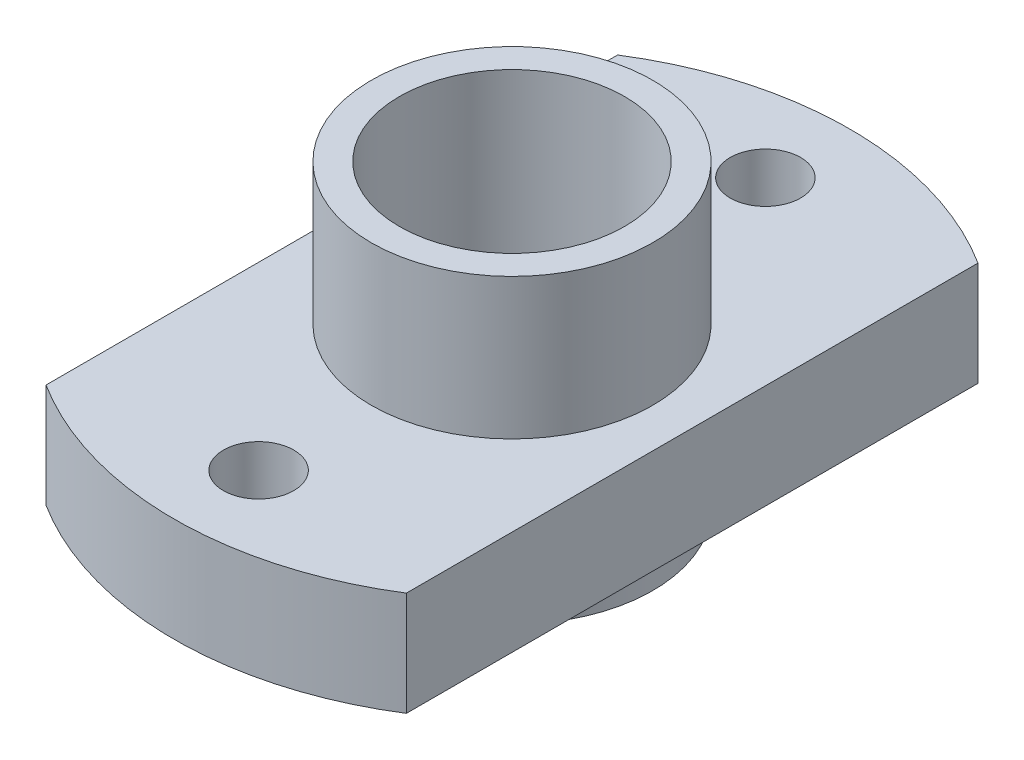
ISO-10303-21;
HEADER;
FILE_DESCRIPTION(('STEP AP214'),'2;1');
FILE_NAME('part.step','',(''),(''),'','','');
FILE_SCHEMA(('AUTOMOTIVE_DESIGN { 1 0 10303 214 1 1 1 1 }'));
ENDSEC;
DATA;
#1=APPLICATION_CONTEXT('core data for automotive mechanical design processes');
#2=APPLICATION_PROTOCOL_DEFINITION('international standard','automotive_design',2000,#1);
#3=PRODUCT_CONTEXT('',#1,'mechanical');
#4=PRODUCT('Part','Part','',(#3));
#5=PRODUCT_RELATED_PRODUCT_CATEGORY('part','',(#4));
#6=PRODUCT_DEFINITION_FORMATION('','',#4);
#7=PRODUCT_DEFINITION_CONTEXT('part definition',#1,'design');
#8=PRODUCT_DEFINITION('design','',#6,#7);
#9=PRODUCT_DEFINITION_SHAPE('','',#8);
#10=(LENGTH_UNIT() NAMED_UNIT(*) SI_UNIT(.MILLI.,.METRE.));
#11=(NAMED_UNIT(*) PLANE_ANGLE_UNIT() SI_UNIT($,.RADIAN.));
#12=(NAMED_UNIT(*) SI_UNIT($,.STERADIAN.) SOLID_ANGLE_UNIT());
#13=UNCERTAINTY_MEASURE_WITH_UNIT(LENGTH_MEASURE(1.E-05),#10,'distance_accuracy_value','');
#14=(GEOMETRIC_REPRESENTATION_CONTEXT(3) GLOBAL_UNCERTAINTY_ASSIGNED_CONTEXT((#13)) GLOBAL_UNIT_ASSIGNED_CONTEXT((#10,
#11,#12)) REPRESENTATION_CONTEXT('',''));
#15=CARTESIAN_POINT('',(0.,0.,0.));
#16=DIRECTION('',(0.,0.,1.));
#17=DIRECTION('',(1.,0.,0.));
#18=AXIS2_PLACEMENT_3D('',#15,#16,#17);
#19=CARTESIAN_POINT('',(0.,0.,0.));
#20=DIRECTION('',(0.,1.,0.));
#21=DIRECTION('',(0.,0.,1.));
#22=AXIS2_PLACEMENT_3D('',#19,#20,#21);
#23=PLANE('',#22);
#24=CARTESIAN_POINT('',(0.,0.,9.));
#25=DIRECTION('',(0.,-1.,0.));
#26=DIRECTION('',(0.,0.,-1.));
#27=AXIS2_PLACEMENT_3D('',#24,#25,#26);
#28=CIRCLE('',#27,1.24999999999999);
#29=CARTESIAN_POINT('',(0.,0.,7.75000000000001));
#30=VERTEX_POINT('',#29);
#31=EDGE_CURVE('E130',#30,#30,#28,.T.);
#32=ORIENTED_EDGE('',*,*,#31,.F.);
#33=EDGE_LOOP('',(#32));
#34=FACE_BOUND('',#33,.T.);
#35=CARTESIAN_POINT('',(0.,0.,0.));
#36=DIRECTION('',(0.,1.,0.));
#37=DIRECTION('',(0.,0.,1.));
#38=AXIS2_PLACEMENT_3D('',#35,#36,#37);
#39=CIRCLE('',#38,5.);
#40=CARTESIAN_POINT('',(0.,0.,5.));
#41=VERTEX_POINT('',#40);
#42=EDGE_CURVE('E40',#41,#41,#39,.T.);
#43=ORIENTED_EDGE('',*,*,#42,.T.);
#44=EDGE_LOOP('',(#43));
#45=FACE_BOUND('',#44,.T.);
#46=CARTESIAN_POINT('',(0.,0.,0.));
#47=DIRECTION('',(0.,1.,0.));
#48=DIRECTION('',(0.,0.,1.));
#49=AXIS2_PLACEMENT_3D('',#46,#47,#48);
#50=CIRCLE('',#49,12.);
#51=CARTESIAN_POINT('',(6.4,0.,-10.1508620323596));
#52=VERTEX_POINT('',#51);
#53=CARTESIAN_POINT('',(-6.4,0.,-10.1508620323596));
#54=VERTEX_POINT('',#53);
#55=EDGE_CURVE('E105',#52,#54,#50,.T.);
#56=ORIENTED_EDGE('',*,*,#55,.F.);
#57=DIRECTION('',(0.,0.,-1.));
#58=VECTOR('',#57,1.);
#59=CARTESIAN_POINT('',(6.4,0.,-10.1508620323596));
#60=LINE('',#59,#58);
#61=CARTESIAN_POINT('',(6.4,0.,10.1508620323596));
#62=VERTEX_POINT('',#61);
#63=EDGE_CURVE('E78',#62,#52,#60,.T.);
#64=ORIENTED_EDGE('',*,*,#63,.F.);
#65=CARTESIAN_POINT('',(0.,0.,0.));
#66=DIRECTION('',(0.,1.,0.));
#67=DIRECTION('',(0.,0.,1.));
#68=AXIS2_PLACEMENT_3D('',#65,#66,#67);
#69=CIRCLE('',#68,12.);
#70=CARTESIAN_POINT('',(-6.4,0.,10.1508620323596));
#71=VERTEX_POINT('',#70);
#72=EDGE_CURVE('E72',#71,#62,#69,.T.);
#73=ORIENTED_EDGE('',*,*,#72,.F.);
#74=DIRECTION('',(0.,0.,1.));
#75=VECTOR('',#74,1.);
#76=CARTESIAN_POINT('',(-6.4,0.,-10.1508620323596));
#77=LINE('',#76,#75);
#78=EDGE_CURVE('E96',#54,#71,#77,.T.);
#79=ORIENTED_EDGE('',*,*,#78,.F.);
#80=EDGE_LOOP('',(#56,#64,#73,#79));
#81=FACE_BOUND('',#80,.T.);
#82=CARTESIAN_POINT('',(0.,0.,-9.));
#83=DIRECTION('',(0.,-1.,0.));
#84=DIRECTION('',(0.,0.,-1.));
#85=AXIS2_PLACEMENT_3D('',#82,#83,#84);
#86=CIRCLE('',#85,1.24999999999999);
#87=CARTESIAN_POINT('',(0.,0.,-10.25));
#88=VERTEX_POINT('',#87);
#89=EDGE_CURVE('E121',#88,#88,#86,.T.);
#90=ORIENTED_EDGE('',*,*,#89,.F.);
#91=EDGE_LOOP('',(#90));
#92=FACE_BOUND('',#91,.T.);
#93=ADVANCED_FACE('F36',(#34,#45,#81,#92),#23,.F.);
#94=CARTESIAN_POINT('',(0.,3.7,0.));
#95=DIRECTION('',(0.,-1.,0.));
#96=DIRECTION('',(0.,0.,-1.));
#97=AXIS2_PLACEMENT_3D('',#94,#95,#96);
#98=CYLINDRICAL_SURFACE('',#97,12.);
#99=ORIENTED_EDGE('',*,*,#55,.T.);
#100=DIRECTION('',(0.,-1.,0.));
#101=VECTOR('',#100,1.);
#102=CARTESIAN_POINT('',(-6.4,3.7,-10.1508620323596));
#103=LINE('',#102,#101);
#104=CARTESIAN_POINT('',(-6.4,3.7,-10.1508620323596));
#105=VERTEX_POINT('',#104);
#106=EDGE_CURVE('E46',#105,#54,#103,.T.);
#107=ORIENTED_EDGE('',*,*,#106,.F.);
#108=CARTESIAN_POINT('',(0.,3.7,0.));
#109=DIRECTION('',(0.,1.,0.));
#110=DIRECTION('',(0.,0.,1.));
#111=AXIS2_PLACEMENT_3D('',#108,#109,#110);
#112=CIRCLE('',#111,12.);
#113=CARTESIAN_POINT('',(6.4,3.7,-10.1508620323596));
#114=VERTEX_POINT('',#113);
#115=EDGE_CURVE('E91',#114,#105,#112,.T.);
#116=ORIENTED_EDGE('',*,*,#115,.F.);
#117=DIRECTION('',(0.,-1.,0.));
#118=VECTOR('',#117,1.);
#119=CARTESIAN_POINT('',(6.4,3.7,-10.1508620323596));
#120=LINE('',#119,#118);
#121=EDGE_CURVE('E101',#114,#52,#120,.T.);
#122=ORIENTED_EDGE('',*,*,#121,.T.);
#123=EDGE_LOOP('',(#99,#107,#116,#122));
#124=FACE_BOUND('',#123,.T.);
#125=ADVANCED_FACE('F38',(#124),#98,.T.);
#126=CARTESIAN_POINT('',(-6.4,3.7,-10.1508620323596));
#127=DIRECTION('',(1.,0.,0.));
#128=DIRECTION('',(0.,0.,-1.));
#129=AXIS2_PLACEMENT_3D('',#126,#127,#128);
#130=PLANE('',#129);
#131=ORIENTED_EDGE('',*,*,#78,.T.);
#132=DIRECTION('',(0.,-1.,0.));
#133=VECTOR('',#132,1.);
#134=CARTESIAN_POINT('',(-6.4,3.7,10.1508620323596));
#135=LINE('',#134,#133);
#136=CARTESIAN_POINT('',(-6.4,3.7,10.1508620323596));
#137=VERTEX_POINT('',#136);
#138=EDGE_CURVE('E94',#137,#71,#135,.T.);
#139=ORIENTED_EDGE('',*,*,#138,.F.);
#140=DIRECTION('',(0.,0.,1.));
#141=VECTOR('',#140,1.);
#142=CARTESIAN_POINT('',(-6.4,3.7,-10.1508620323596));
#143=LINE('',#142,#141);
#144=EDGE_CURVE('E86',#105,#137,#143,.T.);
#145=ORIENTED_EDGE('',*,*,#144,.F.);
#146=ORIENTED_EDGE('',*,*,#106,.T.);
#147=EDGE_LOOP('',(#131,#139,#145,#146));
#148=FACE_BOUND('',#147,.T.);
#149=ADVANCED_FACE('F95',(#148),#130,.F.);
#150=CARTESIAN_POINT('',(0.,3.7,0.));
#151=DIRECTION('',(0.,-1.,0.));
#152=DIRECTION('',(0.,0.,-1.));
#153=AXIS2_PLACEMENT_3D('',#150,#151,#152);
#154=CYLINDRICAL_SURFACE('',#153,12.);
#155=ORIENTED_EDGE('',*,*,#72,.T.);
#156=DIRECTION('',(0.,-1.,0.));
#157=VECTOR('',#156,1.);
#158=CARTESIAN_POINT('',(6.4,3.7,10.1508620323596));
#159=LINE('',#158,#157);
#160=CARTESIAN_POINT('',(6.4,3.7,10.1508620323596));
#161=VERTEX_POINT('',#160);
#162=EDGE_CURVE('E97',#161,#62,#159,.T.);
#163=ORIENTED_EDGE('',*,*,#162,.F.);
#164=CARTESIAN_POINT('',(0.,3.7,0.));
#165=DIRECTION('',(0.,1.,0.));
#166=DIRECTION('',(0.,0.,1.));
#167=AXIS2_PLACEMENT_3D('',#164,#165,#166);
#168=CIRCLE('',#167,12.);
#169=EDGE_CURVE('E89',#137,#161,#168,.T.);
#170=ORIENTED_EDGE('',*,*,#169,.F.);
#171=ORIENTED_EDGE('',*,*,#138,.T.);
#172=EDGE_LOOP('',(#155,#163,#170,#171));
#173=FACE_BOUND('',#172,.T.);
#174=ADVANCED_FACE('F99',(#173),#154,.T.);
#175=CARTESIAN_POINT('',(6.4,3.7,-10.1508620323596));
#176=DIRECTION('',(-1.,0.,0.));
#177=DIRECTION('',(0.,0.,1.));
#178=AXIS2_PLACEMENT_3D('',#175,#176,#177);
#179=PLANE('',#178);
#180=ORIENTED_EDGE('',*,*,#63,.T.);
#181=ORIENTED_EDGE('',*,*,#121,.F.);
#182=DIRECTION('',(0.,0.,-1.));
#183=VECTOR('',#182,1.);
#184=CARTESIAN_POINT('',(6.4,3.7,-10.1508620323596));
#185=LINE('',#184,#183);
#186=EDGE_CURVE('E55',#161,#114,#185,.T.);
#187=ORIENTED_EDGE('',*,*,#186,.F.);
#188=ORIENTED_EDGE('',*,*,#162,.T.);
#189=EDGE_LOOP('',(#180,#181,#187,#188));
#190=FACE_BOUND('',#189,.T.);
#191=ADVANCED_FACE('F160',(#190),#179,.F.);
#192=CARTESIAN_POINT('',(0.,3.7,0.));
#193=DIRECTION('',(0.,1.,0.));
#194=DIRECTION('',(0.,0.,1.));
#195=AXIS2_PLACEMENT_3D('',#192,#193,#194);
#196=PLANE('',#195);
#197=CARTESIAN_POINT('',(0.,3.7,9.));
#198=DIRECTION('',(0.,1.,0.));
#199=DIRECTION('',(0.,0.,1.));
#200=AXIS2_PLACEMENT_3D('',#197,#198,#199);
#201=CIRCLE('',#200,1.24999999999999);
#202=CARTESIAN_POINT('',(0.,3.7,10.25));
#203=VERTEX_POINT('',#202);
#204=EDGE_CURVE('E124',#203,#203,#201,.T.);
#205=ORIENTED_EDGE('',*,*,#204,.F.);
#206=EDGE_LOOP('',(#205));
#207=FACE_BOUND('',#206,.T.);
#208=CARTESIAN_POINT('',(0.,3.7,-9.));
#209=DIRECTION('',(0.,1.,0.));
#210=DIRECTION('',(0.,0.,1.));
#211=AXIS2_PLACEMENT_3D('',#208,#209,#210);
#212=CIRCLE('',#211,1.24999999999999);
#213=CARTESIAN_POINT('',(0.,3.7,-7.75000000000001));
#214=VERTEX_POINT('',#213);
#215=EDGE_CURVE('E123',#214,#214,#212,.T.);
#216=ORIENTED_EDGE('',*,*,#215,.F.);
#217=EDGE_LOOP('',(#216));
#218=FACE_BOUND('',#217,.T.);
#219=CARTESIAN_POINT('',(0.,3.7,0.));
#220=DIRECTION('',(0.,1.,0.));
#221=DIRECTION('',(0.,0.,1.));
#222=AXIS2_PLACEMENT_3D('',#219,#220,#221);
#223=CIRCLE('',#222,5.);
#224=CARTESIAN_POINT('',(0.,3.7,5.));
#225=VERTEX_POINT('',#224);
#226=EDGE_CURVE('E11',#225,#225,#223,.T.);
#227=ORIENTED_EDGE('',*,*,#226,.F.);
#228=EDGE_LOOP('',(#227));
#229=FACE_BOUND('',#228,.T.);
#230=ORIENTED_EDGE('',*,*,#115,.T.);
#231=ORIENTED_EDGE('',*,*,#144,.T.);
#232=ORIENTED_EDGE('',*,*,#169,.T.);
#233=ORIENTED_EDGE('',*,*,#186,.T.);
#234=EDGE_LOOP('',(#230,#231,#232,#233));
#235=FACE_BOUND('',#234,.T.);
#236=ADVANCED_FACE('F87',(#207,#218,#229,#235),#196,.T.);
#237=CARTESIAN_POINT('',(0.,-2.,0.));
#238=DIRECTION('',(0.,1.,0.));
#239=DIRECTION('',(0.,0.,1.));
#240=AXIS2_PLACEMENT_3D('',#237,#238,#239);
#241=PLANE('',#240);
#242=CARTESIAN_POINT('',(0.,-2.,0.));
#243=DIRECTION('',(0.,-1.,0.));
#244=DIRECTION('',(0.,0.,-1.));
#245=AXIS2_PLACEMENT_3D('',#242,#243,#244);
#246=CIRCLE('',#245,4.);
#247=CARTESIAN_POINT('',(0.,-2.,-4.));
#248=VERTEX_POINT('',#247);
#249=EDGE_CURVE('E244',#248,#248,#246,.T.);
#250=ORIENTED_EDGE('',*,*,#249,.F.);
#251=EDGE_LOOP('',(#250));
#252=FACE_BOUND('',#251,.T.);
#253=CARTESIAN_POINT('',(0.,-2.,0.));
#254=DIRECTION('',(0.,1.,0.));
#255=DIRECTION('',(0.,0.,1.));
#256=AXIS2_PLACEMENT_3D('',#253,#254,#255);
#257=CIRCLE('',#256,5.);
#258=CARTESIAN_POINT('',(0.,-2.,5.));
#259=VERTEX_POINT('',#258);
#260=EDGE_CURVE('E136',#259,#259,#257,.T.);
#261=ORIENTED_EDGE('',*,*,#260,.F.);
#262=EDGE_LOOP('',(#261));
#263=FACE_BOUND('',#262,.T.);
#264=ADVANCED_FACE('F147',(#252,#263),#241,.F.);
#265=CARTESIAN_POINT('',(0.,-2.,0.));
#266=DIRECTION('',(0.,1.,0.));
#267=DIRECTION('',(0.,0.,1.));
#268=AXIS2_PLACEMENT_3D('',#265,#266,#267);
#269=CYLINDRICAL_SURFACE('',#268,5.);
#270=ORIENTED_EDGE('',*,*,#260,.T.);
#271=EDGE_LOOP('',(#270));
#272=FACE_BOUND('',#271,.T.);
#273=ORIENTED_EDGE('',*,*,#42,.F.);
#274=EDGE_LOOP('',(#273));
#275=FACE_BOUND('',#274,.T.);
#276=ADVANCED_FACE('F144',(#272,#275),#269,.T.);
#277=ORIENTED_EDGE('',*,*,#226,.T.);
#278=EDGE_LOOP('',(#277));
#279=FACE_BOUND('',#278,.T.);
#280=CARTESIAN_POINT('',(0.,8.7,0.));
#281=DIRECTION('',(0.,1.,0.));
#282=DIRECTION('',(0.,0.,1.));
#283=AXIS2_PLACEMENT_3D('',#280,#281,#282);
#284=CIRCLE('',#283,5.);
#285=CARTESIAN_POINT('',(0.,8.7,5.));
#286=VERTEX_POINT('',#285);
#287=EDGE_CURVE('E127',#286,#286,#284,.T.);
#288=ORIENTED_EDGE('',*,*,#287,.F.);
#289=EDGE_LOOP('',(#288));
#290=FACE_BOUND('',#289,.T.);
#291=ADVANCED_FACE('F146',(#279,#290),#269,.T.);
#292=CARTESIAN_POINT('',(0.,8.7,0.));
#293=DIRECTION('',(0.,1.,0.));
#294=DIRECTION('',(0.,0.,1.));
#295=AXIS2_PLACEMENT_3D('',#292,#293,#294);
#296=PLANE('',#295);
#297=CARTESIAN_POINT('',(0.,8.7,0.));
#298=DIRECTION('',(0.,1.,0.));
#299=DIRECTION('',(0.,0.,1.));
#300=AXIS2_PLACEMENT_3D('',#297,#298,#299);
#301=CIRCLE('',#300,4.);
#302=CARTESIAN_POINT('',(0.,8.7,4.));
#303=VERTEX_POINT('',#302);
#304=EDGE_CURVE('E241',#303,#303,#301,.F.);
#305=ORIENTED_EDGE('',*,*,#304,.T.);
#306=EDGE_LOOP('',(#305));
#307=FACE_BOUND('',#306,.T.);
#308=ORIENTED_EDGE('',*,*,#287,.T.);
#309=EDGE_LOOP('',(#308));
#310=FACE_BOUND('',#309,.T.);
#311=ADVANCED_FACE('F153',(#307,#310),#296,.T.);
#312=CARTESIAN_POINT('',(0.,0.,-9.));
#313=DIRECTION('',(0.,-1.,0.));
#314=DIRECTION('',(0.,0.,-1.));
#315=AXIS2_PLACEMENT_3D('',#312,#313,#314);
#316=CYLINDRICAL_SURFACE('',#315,1.24999999999999);
#317=ORIENTED_EDGE('',*,*,#89,.T.);
#318=EDGE_LOOP('',(#317));
#319=FACE_BOUND('',#318,.T.);
#320=ORIENTED_EDGE('',*,*,#215,.T.);
#321=EDGE_LOOP('',(#320));
#322=FACE_BOUND('',#321,.T.);
#323=ADVANCED_FACE('F194',(#319,#322),#316,.F.);
#324=CARTESIAN_POINT('',(0.,0.,9.));
#325=DIRECTION('',(0.,-1.,0.));
#326=DIRECTION('',(0.,0.,-1.));
#327=AXIS2_PLACEMENT_3D('',#324,#325,#326);
#328=CYLINDRICAL_SURFACE('',#327,1.24999999999999);
#329=ORIENTED_EDGE('',*,*,#31,.T.);
#330=EDGE_LOOP('',(#329));
#331=FACE_BOUND('',#330,.T.);
#332=ORIENTED_EDGE('',*,*,#204,.T.);
#333=EDGE_LOOP('',(#332));
#334=FACE_BOUND('',#333,.T.);
#335=ADVANCED_FACE('F199',(#331,#334),#328,.F.);
#336=CARTESIAN_POINT('',(0.,8.701,0.));
#337=DIRECTION('',(0.,-1.,0.));
#338=DIRECTION('',(0.,0.,-1.));
#339=AXIS2_PLACEMENT_3D('',#336,#337,#338);
#340=CYLINDRICAL_SURFACE('',#339,4.);
#341=ORIENTED_EDGE('',*,*,#304,.F.);
#342=EDGE_LOOP('',(#341));
#343=FACE_BOUND('',#342,.T.);
#344=ORIENTED_EDGE('',*,*,#249,.T.);
#345=EDGE_LOOP('',(#344));
#346=FACE_BOUND('',#345,.T.);
#347=ADVANCED_FACE('F209',(#343,#346),#340,.F.);
#348=CLOSED_SHELL('',(#93,#125,#149,#174,#191,#236,#264,#276,#291,#311,#323,#335,#347));
#349=MANIFOLD_SOLID_BREP('B2',#348);
#350=ADVANCED_BREP_SHAPE_REPRESENTATION('',(#18,#349),#14);
#351=SHAPE_DEFINITION_REPRESENTATION(#9,#350);
ENDSEC;
END-ISO-10303-21;
